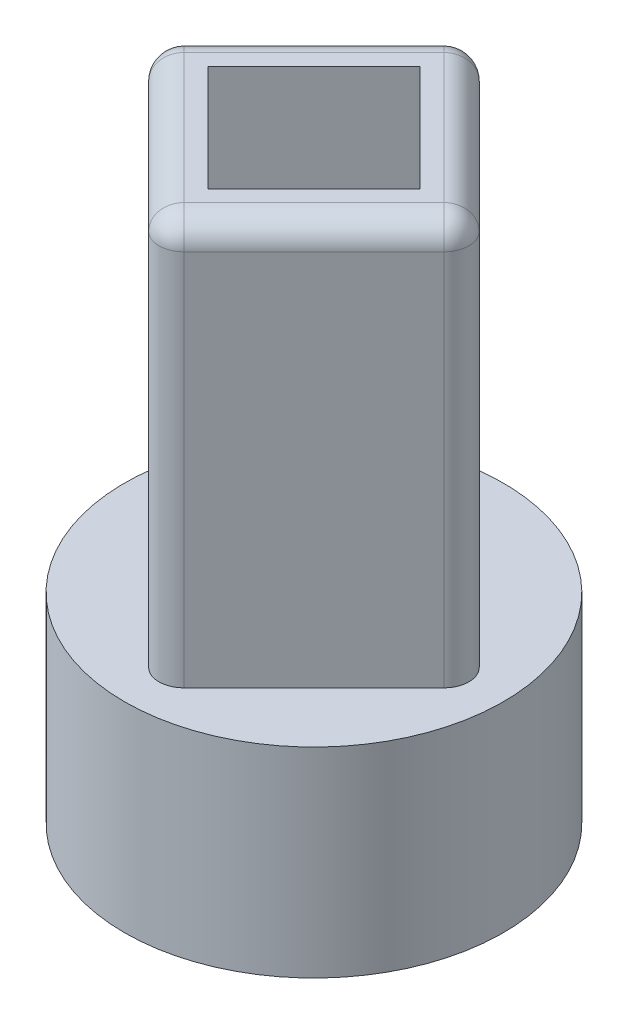
ISO-10303-21;
HEADER;
FILE_DESCRIPTION(('STEP AP214'),'2;1');
FILE_NAME('part.step','',(''),(''),'','','');
FILE_SCHEMA(('AUTOMOTIVE_DESIGN { 1 0 10303 214 1 1 1 1 }'));
ENDSEC;
DATA;
#1=APPLICATION_CONTEXT('core data for automotive mechanical design processes');
#2=APPLICATION_PROTOCOL_DEFINITION('international standard','automotive_design',2000,#1);
#3=PRODUCT_CONTEXT('',#1,'mechanical');
#4=PRODUCT('Part','Part','',(#3));
#5=PRODUCT_RELATED_PRODUCT_CATEGORY('part','',(#4));
#6=PRODUCT_DEFINITION_FORMATION('','',#4);
#7=PRODUCT_DEFINITION_CONTEXT('part definition',#1,'design');
#8=PRODUCT_DEFINITION('design','',#6,#7);
#9=PRODUCT_DEFINITION_SHAPE('','',#8);
#10=(LENGTH_UNIT() NAMED_UNIT(*) SI_UNIT(.MILLI.,.METRE.));
#11=(NAMED_UNIT(*) PLANE_ANGLE_UNIT() SI_UNIT($,.RADIAN.));
#12=(NAMED_UNIT(*) SI_UNIT($,.STERADIAN.) SOLID_ANGLE_UNIT());
#13=UNCERTAINTY_MEASURE_WITH_UNIT(LENGTH_MEASURE(1.E-05),#10,'distance_accuracy_value','');
#14=(GEOMETRIC_REPRESENTATION_CONTEXT(3) GLOBAL_UNCERTAINTY_ASSIGNED_CONTEXT((#13)) GLOBAL_UNIT_ASSIGNED_CONTEXT((#10,
#11,#12)) REPRESENTATION_CONTEXT('',''));
#15=CARTESIAN_POINT('',(0.,0.,0.));
#16=DIRECTION('',(0.,0.,1.));
#17=DIRECTION('',(1.,0.,0.));
#18=AXIS2_PLACEMENT_3D('',#15,#16,#17);
#19=CARTESIAN_POINT('',(0.,24.1,0.));
#20=DIRECTION('',(0.,1.,0.));
#21=DIRECTION('',(0.,0.,1.));
#22=AXIS2_PLACEMENT_3D('',#19,#20,#21);
#23=PLANE('',#22);
#24=DIRECTION('',(-0.707106781186548,0.,-0.707106781186547));
#25=VECTOR('',#24,1.);
#26=CARTESIAN_POINT('',(-0.70710678118655,24.1,-5.90434162290767));
#27=LINE('',#26,#25);
#28=CARTESIAN_POINT('',(5.19723484172112,24.1,0.));
#29=VERTEX_POINT('',#28);
#30=CARTESIAN_POINT('',(0.,24.1,-5.19723484172112));
#31=VERTEX_POINT('',#30);
#32=EDGE_CURVE('E286',#29,#31,#27,.T.);
#33=ORIENTED_EDGE('',*,*,#32,.T.);
#34=DIRECTION('',(-0.707106781186547,0.,0.707106781186548));
#35=VECTOR('',#34,1.);
#36=CARTESIAN_POINT('',(-5.90434162290767,24.1,0.707106781186549));
#37=LINE('',#36,#35);
#38=CARTESIAN_POINT('',(-5.19723484172112,24.1,0.));
#39=VERTEX_POINT('',#38);
#40=EDGE_CURVE('E292',#31,#39,#37,.T.);
#41=ORIENTED_EDGE('',*,*,#40,.T.);
#42=DIRECTION('',(0.707106781186548,0.,0.707106781186547));
#43=VECTOR('',#42,1.);
#44=CARTESIAN_POINT('',(0.707106781186548,24.1,5.90434162290767));
#45=LINE('',#44,#43);
#46=CARTESIAN_POINT('',(0.,24.1,5.19723484172112));
#47=VERTEX_POINT('',#46);
#48=EDGE_CURVE('E290',#39,#47,#45,.T.);
#49=ORIENTED_EDGE('',*,*,#48,.T.);
#50=DIRECTION('',(0.707106781186548,0.,-0.707106781186548));
#51=VECTOR('',#50,1.);
#52=CARTESIAN_POINT('',(5.90434162290767,24.1,-0.707106781186549));
#53=LINE('',#52,#51);
#54=EDGE_CURVE('E288',#47,#29,#53,.T.);
#55=ORIENTED_EDGE('',*,*,#54,.T.);
#56=EDGE_LOOP('',(#33,#41,#49,#55));
#57=FACE_BOUND('',#56,.T.);
#58=DIRECTION('',(-0.707106781186548,0.,-0.707106781186547));
#59=VECTOR('',#58,1.);
#60=CARTESIAN_POINT('',(4.24264068711928,24.1,0.));
#61=LINE('',#60,#59);
#62=CARTESIAN_POINT('',(4.24264068711928,24.1,0.));
#63=VERTEX_POINT('',#62);
#64=CARTESIAN_POINT('',(0.,24.1,-4.24264068711928));
#65=VERTEX_POINT('',#64);
#66=EDGE_CURVE('E249',#63,#65,#61,.T.);
#67=ORIENTED_EDGE('',*,*,#66,.F.);
#68=DIRECTION('',(0.707106781186548,0.,-0.707106781186548));
#69=VECTOR('',#68,1.);
#70=CARTESIAN_POINT('',(0.,24.1,4.24264068711928));
#71=LINE('',#70,#69);
#72=CARTESIAN_POINT('',(0.,24.1,4.24264068711928));
#73=VERTEX_POINT('',#72);
#74=EDGE_CURVE('E247',#73,#63,#71,.T.);
#75=ORIENTED_EDGE('',*,*,#74,.F.);
#76=DIRECTION('',(0.707106781186548,0.,0.707106781186547));
#77=VECTOR('',#76,1.);
#78=CARTESIAN_POINT('',(-4.24264068711928,24.1,0.));
#79=LINE('',#78,#77);
#80=CARTESIAN_POINT('',(-4.24264068711928,24.1,0.));
#81=VERTEX_POINT('',#80);
#82=EDGE_CURVE('E254',#81,#73,#79,.T.);
#83=ORIENTED_EDGE('',*,*,#82,.F.);
#84=DIRECTION('',(-0.707106781186547,0.,0.707106781186548));
#85=VECTOR('',#84,1.);
#86=CARTESIAN_POINT('',(0.,24.1,-4.24264068711928));
#87=LINE('',#86,#85);
#88=EDGE_CURVE('E251',#65,#81,#87,.T.);
#89=ORIENTED_EDGE('',*,*,#88,.F.);
#90=EDGE_LOOP('',(#67,#75,#83,#89));
#91=FACE_BOUND('',#90,.T.);
#92=ADVANCED_FACE('F43',(#57,#91),#23,.T.);
#93=CARTESIAN_POINT('',(0.,24.1,6.61144840409422));
#94=DIRECTION('',(-0.707106781186548,0.,-0.707106781186548));
#95=DIRECTION('',(-0.707106781186548,0.,0.707106781186548));
#96=AXIS2_PLACEMENT_3D('',#93,#94,#95);
#97=PLANE('',#96);
#98=DIRECTION('',(0.,-1.,0.));
#99=VECTOR('',#98,1.);
#100=CARTESIAN_POINT('',(0.707106781186547,24.1,5.90434162290767));
#101=LINE('',#100,#99);
#102=CARTESIAN_POINT('',(0.707106781186548,23.1,5.90434162290767));
#103=VERTEX_POINT('',#102);
#104=CARTESIAN_POINT('',(0.707106781186547,8.,5.90434162290767));
#105=VERTEX_POINT('',#104);
#106=EDGE_CURVE('E302',#103,#105,#101,.T.);
#107=ORIENTED_EDGE('',*,*,#106,.T.);
#108=DIRECTION('',(0.707106781186548,0.,-0.707106781186548));
#109=VECTOR('',#108,1.);
#110=CARTESIAN_POINT('',(0.707106781186548,8.,5.90434162290767));
#111=LINE('',#110,#109);
#112=CARTESIAN_POINT('',(5.90434162290767,8.,0.707106781186548));
#113=VERTEX_POINT('',#112);
#114=EDGE_CURVE('E60',#105,#113,#111,.T.);
#115=ORIENTED_EDGE('',*,*,#114,.T.);
#116=DIRECTION('',(0.,-1.,0.));
#117=VECTOR('',#116,1.);
#118=CARTESIAN_POINT('',(5.90434162290767,24.1,0.707106781186548));
#119=LINE('',#118,#117);
#120=CARTESIAN_POINT('',(5.90434162290767,23.1,0.707106781186547));
#121=VERTEX_POINT('',#120);
#122=EDGE_CURVE('E306',#113,#121,#119,.F.);
#123=ORIENTED_EDGE('',*,*,#122,.T.);
#124=DIRECTION('',(0.707106781186548,0.,-0.707106781186548));
#125=VECTOR('',#124,1.);
#126=CARTESIAN_POINT('',(0.,23.1,6.61144840409422));
#127=LINE('',#126,#125);
#128=EDGE_CURVE('E304',#121,#103,#127,.F.);
#129=ORIENTED_EDGE('',*,*,#128,.T.);
#130=EDGE_LOOP('',(#107,#115,#123,#129));
#131=FACE_BOUND('',#130,.T.);
#132=ADVANCED_FACE('F360',(#131),#97,.F.);
#133=CARTESIAN_POINT('',(6.61144840409422,24.1,0.));
#134=DIRECTION('',(-0.707106781186547,0.,0.707106781186548));
#135=DIRECTION('',(0.707106781186548,0.,0.707106781186547));
#136=AXIS2_PLACEMENT_3D('',#133,#134,#135);
#137=PLANE('',#136);
#138=DIRECTION('',(0.,-1.,0.));
#139=VECTOR('',#138,1.);
#140=CARTESIAN_POINT('',(5.90434162290767,24.1,-0.707106781186549));
#141=LINE('',#140,#139);
#142=CARTESIAN_POINT('',(5.90434162290767,23.1,-0.707106781186549));
#143=VERTEX_POINT('',#142);
#144=CARTESIAN_POINT('',(5.90434162290767,8.,-0.707106781186549));
#145=VERTEX_POINT('',#144);
#146=EDGE_CURVE('E11',#143,#145,#141,.T.);
#147=ORIENTED_EDGE('',*,*,#146,.T.);
#148=DIRECTION('',(-0.707106781186548,0.,-0.707106781186547));
#149=VECTOR('',#148,1.);
#150=CARTESIAN_POINT('',(5.90434162290767,8.,-0.707106781186549));
#151=LINE('',#150,#149);
#152=CARTESIAN_POINT('',(0.707106781186545,8.,-5.90434162290767));
#153=VERTEX_POINT('',#152);
#154=EDGE_CURVE('E207',#145,#153,#151,.T.);
#155=ORIENTED_EDGE('',*,*,#154,.T.);
#156=DIRECTION('',(0.,-1.,0.));
#157=VECTOR('',#156,1.);
#158=CARTESIAN_POINT('',(0.707106781186545,24.1,-5.90434162290767));
#159=LINE('',#158,#157);
#160=CARTESIAN_POINT('',(0.707106781186546,23.1,-5.90434162290767));
#161=VERTEX_POINT('',#160);
#162=EDGE_CURVE('E308',#153,#161,#159,.F.);
#163=ORIENTED_EDGE('',*,*,#162,.T.);
#164=DIRECTION('',(-0.707106781186548,0.,-0.707106781186547));
#165=VECTOR('',#164,1.);
#166=CARTESIAN_POINT('',(6.61144840409422,23.1,0.));
#167=LINE('',#166,#165);
#168=EDGE_CURVE('E52',#161,#143,#167,.F.);
#169=ORIENTED_EDGE('',*,*,#168,.T.);
#170=EDGE_LOOP('',(#147,#155,#163,#169));
#171=FACE_BOUND('',#170,.T.);
#172=ADVANCED_FACE('F369',(#171),#137,.F.);
#173=CARTESIAN_POINT('',(0.,24.1,-6.61144840409422));
#174=DIRECTION('',(0.707106781186548,0.,0.707106781186547));
#175=DIRECTION('',(0.707106781186547,0.,-0.707106781186548));
#176=AXIS2_PLACEMENT_3D('',#173,#174,#175);
#177=PLANE('',#176);
#178=DIRECTION('',(0.,-1.,0.));
#179=VECTOR('',#178,1.);
#180=CARTESIAN_POINT('',(-0.707106781186549,24.1,-5.90434162290767));
#181=LINE('',#180,#179);
#182=CARTESIAN_POINT('',(-0.707106781186549,23.1,-5.90434162290767));
#183=VERTEX_POINT('',#182);
#184=CARTESIAN_POINT('',(-0.707106781186549,8.,-5.90434162290767));
#185=VERTEX_POINT('',#184);
#186=EDGE_CURVE('E190',#183,#185,#181,.T.);
#187=ORIENTED_EDGE('',*,*,#186,.T.);
#188=DIRECTION('',(-0.707106781186547,0.,0.707106781186548));
#189=VECTOR('',#188,1.);
#190=CARTESIAN_POINT('',(-0.707106781186549,8.,-5.90434162290767));
#191=LINE('',#190,#189);
#192=CARTESIAN_POINT('',(-5.90434162290767,8.,-0.707106781186546));
#193=VERTEX_POINT('',#192);
#194=EDGE_CURVE('E187',#185,#193,#191,.T.);
#195=ORIENTED_EDGE('',*,*,#194,.T.);
#196=DIRECTION('',(0.,-1.,0.));
#197=VECTOR('',#196,1.);
#198=CARTESIAN_POINT('',(-5.90434162290767,24.1,-0.707106781186547));
#199=LINE('',#198,#197);
#200=CARTESIAN_POINT('',(-5.90434162290767,23.1,-0.707106781186547));
#201=VERTEX_POINT('',#200);
#202=EDGE_CURVE('E170',#193,#201,#199,.F.);
#203=ORIENTED_EDGE('',*,*,#202,.T.);
#204=DIRECTION('',(-0.707106781186547,0.,0.707106781186548));
#205=VECTOR('',#204,1.);
#206=CARTESIAN_POINT('',(0.,23.1,-6.61144840409422));
#207=LINE('',#206,#205);
#208=EDGE_CURVE('E183',#201,#183,#207,.F.);
#209=ORIENTED_EDGE('',*,*,#208,.T.);
#210=EDGE_LOOP('',(#187,#195,#203,#209));
#211=FACE_BOUND('',#210,.T.);
#212=ADVANCED_FACE('F188',(#211),#177,.F.);
#213=CARTESIAN_POINT('',(-6.61144840409422,24.1,0.));
#214=DIRECTION('',(0.707106781186547,0.,-0.707106781186547));
#215=DIRECTION('',(-0.707106781186548,0.,-0.707106781186547));
#216=AXIS2_PLACEMENT_3D('',#213,#214,#215);
#217=PLANE('',#216);
#218=DIRECTION('',(0.,-1.,0.));
#219=VECTOR('',#218,1.);
#220=CARTESIAN_POINT('',(-5.90434162290767,24.1,0.707106781186549));
#221=LINE('',#220,#219);
#222=CARTESIAN_POINT('',(-5.90434162290767,23.1,0.707106781186549));
#223=VERTEX_POINT('',#222);
#224=CARTESIAN_POINT('',(-5.90434162290767,8.,0.707106781186549));
#225=VERTEX_POINT('',#224);
#226=EDGE_CURVE('E182',#223,#225,#221,.T.);
#227=ORIENTED_EDGE('',*,*,#226,.T.);
#228=DIRECTION('',(0.707106781186548,0.,0.707106781186548));
#229=VECTOR('',#228,1.);
#230=CARTESIAN_POINT('',(-5.90434162290767,8.,0.707106781186549));
#231=LINE('',#230,#229);
#232=CARTESIAN_POINT('',(-0.707106781186547,8.,5.90434162290767));
#233=VERTEX_POINT('',#232);
#234=EDGE_CURVE('E199',#225,#233,#231,.T.);
#235=ORIENTED_EDGE('',*,*,#234,.T.);
#236=DIRECTION('',(0.,-1.,0.));
#237=VECTOR('',#236,1.);
#238=CARTESIAN_POINT('',(-0.707106781186547,24.1,5.90434162290767));
#239=LINE('',#238,#237);
#240=CARTESIAN_POINT('',(-0.707106781186548,23.1,5.90434162290767));
#241=VERTEX_POINT('',#240);
#242=EDGE_CURVE('E300',#233,#241,#239,.F.);
#243=ORIENTED_EDGE('',*,*,#242,.T.);
#244=DIRECTION('',(0.707106781186548,0.,0.707106781186547));
#245=VECTOR('',#244,1.);
#246=CARTESIAN_POINT('',(-6.61144840409422,23.1,0.));
#247=LINE('',#246,#245);
#248=EDGE_CURVE('E298',#241,#223,#247,.F.);
#249=ORIENTED_EDGE('',*,*,#248,.T.);
#250=EDGE_LOOP('',(#227,#235,#243,#249));
#251=FACE_BOUND('',#250,.T.);
#252=ADVANCED_FACE('F406',(#251),#217,.F.);
#253=CARTESIAN_POINT('',(0.,24.1,4.24264068711928));
#254=DIRECTION('',(-0.707106781186548,0.,-0.707106781186548));
#255=DIRECTION('',(-0.707106781186548,0.,0.707106781186548));
#256=AXIS2_PLACEMENT_3D('',#253,#254,#255);
#257=PLANE('',#256);
#258=DIRECTION('',(0.707106781186548,0.,-0.707106781186548));
#259=VECTOR('',#258,1.);
#260=CARTESIAN_POINT('',(0.,10.05,4.24264068711928));
#261=LINE('',#260,#259);
#262=CARTESIAN_POINT('',(0.,10.05,4.24264068711928));
#263=VERTEX_POINT('',#262);
#264=CARTESIAN_POINT('',(4.24264068711928,10.05,0.));
#265=VERTEX_POINT('',#264);
#266=EDGE_CURVE('E237',#263,#265,#261,.T.);
#267=ORIENTED_EDGE('',*,*,#266,.F.);
#268=DIRECTION('',(0.,-1.,0.));
#269=VECTOR('',#268,1.);
#270=CARTESIAN_POINT('',(0.,24.1,4.24264068711928));
#271=LINE('',#270,#269);
#272=EDGE_CURVE('E256',#73,#263,#271,.T.);
#273=ORIENTED_EDGE('',*,*,#272,.F.);
#274=ORIENTED_EDGE('',*,*,#74,.T.);
#275=DIRECTION('',(0.,-1.,0.));
#276=VECTOR('',#275,1.);
#277=CARTESIAN_POINT('',(4.24264068711928,24.1,0.));
#278=LINE('',#277,#276);
#279=EDGE_CURVE('E264',#63,#265,#278,.T.);
#280=ORIENTED_EDGE('',*,*,#279,.T.);
#281=EDGE_LOOP('',(#267,#273,#274,#280));
#282=FACE_BOUND('',#281,.T.);
#283=ADVANCED_FACE('F404',(#282),#257,.T.);
#284=CARTESIAN_POINT('',(4.24264068711928,24.1,0.));
#285=DIRECTION('',(-0.707106781186547,0.,0.707106781186548));
#286=DIRECTION('',(0.707106781186548,0.,0.707106781186547));
#287=AXIS2_PLACEMENT_3D('',#284,#285,#286);
#288=PLANE('',#287);
#289=DIRECTION('',(-0.707106781186548,0.,-0.707106781186547));
#290=VECTOR('',#289,1.);
#291=CARTESIAN_POINT('',(4.24264068711928,10.05,0.));
#292=LINE('',#291,#290);
#293=CARTESIAN_POINT('',(0.,10.05,-4.24264068711928));
#294=VERTEX_POINT('',#293);
#295=EDGE_CURVE('E240',#265,#294,#292,.T.);
#296=ORIENTED_EDGE('',*,*,#295,.F.);
#297=ORIENTED_EDGE('',*,*,#279,.F.);
#298=ORIENTED_EDGE('',*,*,#66,.T.);
#299=DIRECTION('',(0.,-1.,0.));
#300=VECTOR('',#299,1.);
#301=CARTESIAN_POINT('',(0.,24.1,-4.24264068711928));
#302=LINE('',#301,#300);
#303=EDGE_CURVE('E261',#65,#294,#302,.T.);
#304=ORIENTED_EDGE('',*,*,#303,.T.);
#305=EDGE_LOOP('',(#296,#297,#298,#304));
#306=FACE_BOUND('',#305,.T.);
#307=ADVANCED_FACE('F477',(#306),#288,.T.);
#308=CARTESIAN_POINT('',(0.,24.1,-4.24264068711928));
#309=DIRECTION('',(0.707106781186548,0.,0.707106781186547));
#310=DIRECTION('',(0.707106781186547,0.,-0.707106781186548));
#311=AXIS2_PLACEMENT_3D('',#308,#309,#310);
#312=PLANE('',#311);
#313=DIRECTION('',(-0.707106781186547,0.,0.707106781186548));
#314=VECTOR('',#313,1.);
#315=CARTESIAN_POINT('',(0.,10.05,-4.24264068711928));
#316=LINE('',#315,#314);
#317=CARTESIAN_POINT('',(-4.24264068711928,10.05,0.));
#318=VERTEX_POINT('',#317);
#319=EDGE_CURVE('E243',#294,#318,#316,.T.);
#320=ORIENTED_EDGE('',*,*,#319,.F.);
#321=ORIENTED_EDGE('',*,*,#303,.F.);
#322=ORIENTED_EDGE('',*,*,#88,.T.);
#323=DIRECTION('',(0.,-1.,0.));
#324=VECTOR('',#323,1.);
#325=CARTESIAN_POINT('',(-4.24264068711928,24.1,0.));
#326=LINE('',#325,#324);
#327=EDGE_CURVE('E258',#81,#318,#326,.T.);
#328=ORIENTED_EDGE('',*,*,#327,.T.);
#329=EDGE_LOOP('',(#320,#321,#322,#328));
#330=FACE_BOUND('',#329,.T.);
#331=ADVANCED_FACE('F486',(#330),#312,.T.);
#332=CARTESIAN_POINT('',(-4.24264068711928,24.1,0.));
#333=DIRECTION('',(0.707106781186547,0.,-0.707106781186548));
#334=DIRECTION('',(-0.707106781186548,0.,-0.707106781186547));
#335=AXIS2_PLACEMENT_3D('',#332,#333,#334);
#336=PLANE('',#335);
#337=DIRECTION('',(0.707106781186548,0.,0.707106781186547));
#338=VECTOR('',#337,1.);
#339=CARTESIAN_POINT('',(-4.24264068711928,10.05,0.));
#340=LINE('',#339,#338);
#341=EDGE_CURVE('E232',#318,#263,#340,.T.);
#342=ORIENTED_EDGE('',*,*,#341,.F.);
#343=ORIENTED_EDGE('',*,*,#327,.F.);
#344=ORIENTED_EDGE('',*,*,#82,.T.);
#345=ORIENTED_EDGE('',*,*,#272,.T.);
#346=EDGE_LOOP('',(#342,#343,#344,#345));
#347=FACE_BOUND('',#346,.T.);
#348=ADVANCED_FACE('F494',(#347),#336,.T.);
#349=CARTESIAN_POINT('',(5.19723484172112,24.1,0.));
#350=DIRECTION('',(0.,-1.,0.));
#351=DIRECTION('',(0.,0.,-1.));
#352=AXIS2_PLACEMENT_3D('',#349,#350,#351);
#353=CYLINDRICAL_SURFACE('',#352,1.);
#354=CARTESIAN_POINT('',(5.19723484172112,8.,0.));
#355=DIRECTION('',(0.,1.,0.));
#356=DIRECTION('',(0.,0.,1.));
#357=AXIS2_PLACEMENT_3D('',#354,#355,#356);
#358=CIRCLE('',#357,1.);
#359=EDGE_CURVE('E67',#113,#145,#358,.T.);
#360=ORIENTED_EDGE('',*,*,#359,.T.);
#361=ORIENTED_EDGE('',*,*,#146,.F.);
#362=CARTESIAN_POINT('',(5.19723484172112,23.1,0.));
#363=DIRECTION('',(0.,1.,0.));
#364=DIRECTION('',(0.,0.,1.));
#365=AXIS2_PLACEMENT_3D('',#362,#363,#364);
#366=CIRCLE('',#365,1.);
#367=EDGE_CURVE('E47',#121,#143,#366,.T.);
#368=ORIENTED_EDGE('',*,*,#367,.F.);
#369=ORIENTED_EDGE('',*,*,#122,.F.);
#370=EDGE_LOOP('',(#360,#361,#368,#369));
#371=FACE_BOUND('',#370,.T.);
#372=ADVANCED_FACE('F45',(#371),#353,.T.);
#373=CARTESIAN_POINT('',(2.59861742086056,23.1,2.59861742086056));
#374=DIRECTION('',(-0.707106781186548,0.,0.707106781186548));
#375=DIRECTION('',(0.707106781186548,0.,0.707106781186548));
#376=AXIS2_PLACEMENT_3D('',#373,#374,#375);
#377=CYLINDRICAL_SURFACE('',#376,1.);
#378=CARTESIAN_POINT('',(0.,23.1,5.19723484172112));
#379=DIRECTION('',(-0.707106781186547,0.,0.707106781186547));
#380=DIRECTION('',(0.707106781186548,0.,0.707106781186548));
#381=AXIS2_PLACEMENT_3D('',#378,#379,#380);
#382=CIRCLE('',#381,1.);
#383=EDGE_CURVE('E333',#103,#47,#382,.T.);
#384=ORIENTED_EDGE('',*,*,#383,.F.);
#385=ORIENTED_EDGE('',*,*,#128,.F.);
#386=CARTESIAN_POINT('',(5.19723484172112,23.1,0.));
#387=DIRECTION('',(0.707106781186548,0.,-0.707106781186547));
#388=DIRECTION('',(-0.707106781186547,0.,-0.707106781186548));
#389=AXIS2_PLACEMENT_3D('',#386,#387,#388);
#390=CIRCLE('',#389,1.);
#391=EDGE_CURVE('E335',#29,#121,#390,.T.);
#392=ORIENTED_EDGE('',*,*,#391,.F.);
#393=ORIENTED_EDGE('',*,*,#54,.F.);
#394=EDGE_LOOP('',(#384,#385,#392,#393));
#395=FACE_BOUND('',#394,.T.);
#396=ADVANCED_FACE('F358',(#395),#377,.T.);
#397=CARTESIAN_POINT('',(0.,24.1,5.19723484172112));
#398=DIRECTION('',(0.,-1.,0.));
#399=DIRECTION('',(0.,0.,-1.));
#400=AXIS2_PLACEMENT_3D('',#397,#398,#399);
#401=CYLINDRICAL_SURFACE('',#400,1.);
#402=CARTESIAN_POINT('',(0.,8.,5.19723484172112));
#403=DIRECTION('',(0.,1.,0.));
#404=DIRECTION('',(0.,0.,1.));
#405=AXIS2_PLACEMENT_3D('',#402,#403,#404);
#406=CIRCLE('',#405,1.);
#407=EDGE_CURVE('E201',#233,#105,#406,.T.);
#408=ORIENTED_EDGE('',*,*,#407,.T.);
#409=ORIENTED_EDGE('',*,*,#106,.F.);
#410=CARTESIAN_POINT('',(0.,23.1,5.19723484172112));
#411=DIRECTION('',(0.,1.,0.));
#412=DIRECTION('',(0.,0.,1.));
#413=AXIS2_PLACEMENT_3D('',#410,#411,#412);
#414=CIRCLE('',#413,1.);
#415=EDGE_CURVE('E330',#241,#103,#414,.T.);
#416=ORIENTED_EDGE('',*,*,#415,.F.);
#417=ORIENTED_EDGE('',*,*,#242,.F.);
#418=EDGE_LOOP('',(#408,#409,#416,#417));
#419=FACE_BOUND('',#418,.T.);
#420=ADVANCED_FACE('F363',(#419),#401,.T.);
#421=CARTESIAN_POINT('',(5.19723484172112,23.1,0.));
#422=DIRECTION('',(0.707106781186548,0.,0.707106781186547));
#423=DIRECTION('',(0.707106781186547,0.,-0.707106781186548));
#424=AXIS2_PLACEMENT_3D('',#421,#422,#423);
#425=SPHERICAL_SURFACE('',#424,1.);
#426=ORIENTED_EDGE('',*,*,#391,.T.);
#427=ORIENTED_EDGE('',*,*,#367,.T.);
#428=CARTESIAN_POINT('',(5.19723484172112,23.1,0.));
#429=DIRECTION('',(0.707106781186548,0.,0.707106781186547));
#430=DIRECTION('',(0.707106781186547,0.,-0.707106781186548));
#431=AXIS2_PLACEMENT_3D('',#428,#429,#430);
#432=CIRCLE('',#431,1.);
#433=EDGE_CURVE('E327',#29,#143,#432,.F.);
#434=ORIENTED_EDGE('',*,*,#433,.F.);
#435=EDGE_LOOP('',(#426,#427,#434));
#436=FACE_BOUND('',#435,.T.);
#437=ADVANCED_FACE('F342',(#436),#425,.T.);
#438=CARTESIAN_POINT('',(0.,23.1,5.19723484172112));
#439=DIRECTION('',(0.707106781186548,0.,0.707106781186547));
#440=DIRECTION('',(0.707106781186547,0.,-0.707106781186548));
#441=AXIS2_PLACEMENT_3D('',#438,#439,#440);
#442=SPHERICAL_SURFACE('',#441,1.);
#443=ORIENTED_EDGE('',*,*,#415,.T.);
#444=ORIENTED_EDGE('',*,*,#383,.T.);
#445=CARTESIAN_POINT('',(0.,23.1,5.19723484172112));
#446=DIRECTION('',(0.707106781186548,0.,0.707106781186547));
#447=DIRECTION('',(0.707106781186547,0.,-0.707106781186548));
#448=AXIS2_PLACEMENT_3D('',#445,#446,#447);
#449=CIRCLE('',#448,1.);
#450=EDGE_CURVE('E324',#241,#47,#449,.F.);
#451=ORIENTED_EDGE('',*,*,#450,.F.);
#452=EDGE_LOOP('',(#443,#444,#451));
#453=FACE_BOUND('',#452,.T.);
#454=ADVANCED_FACE('F384',(#453),#442,.T.);
#455=CARTESIAN_POINT('',(0.,24.1,-5.19723484172112));
#456=DIRECTION('',(0.,-1.,0.));
#457=DIRECTION('',(0.,0.,-1.));
#458=AXIS2_PLACEMENT_3D('',#455,#456,#457);
#459=CYLINDRICAL_SURFACE('',#458,1.);
#460=CARTESIAN_POINT('',(0.,8.,-5.19723484172112));
#461=DIRECTION('',(0.,1.,0.));
#462=DIRECTION('',(0.,0.,1.));
#463=AXIS2_PLACEMENT_3D('',#460,#461,#462);
#464=CIRCLE('',#463,1.);
#465=EDGE_CURVE('E194',#153,#185,#464,.T.);
#466=ORIENTED_EDGE('',*,*,#465,.T.);
#467=ORIENTED_EDGE('',*,*,#186,.F.);
#468=CARTESIAN_POINT('',(0.,23.1,-5.19723484172112));
#469=DIRECTION('',(0.,1.,0.));
#470=DIRECTION('',(0.,0.,1.));
#471=AXIS2_PLACEMENT_3D('',#468,#469,#470);
#472=CIRCLE('',#471,1.);
#473=EDGE_CURVE('E321',#161,#183,#472,.T.);
#474=ORIENTED_EDGE('',*,*,#473,.F.);
#475=ORIENTED_EDGE('',*,*,#162,.F.);
#476=EDGE_LOOP('',(#466,#467,#474,#475));
#477=FACE_BOUND('',#476,.T.);
#478=ADVANCED_FACE('F371',(#477),#459,.T.);
#479=CARTESIAN_POINT('',(2.59861742086056,23.1,-2.59861742086056));
#480=DIRECTION('',(0.707106781186548,0.,0.707106781186547));
#481=DIRECTION('',(0.707106781186547,0.,-0.707106781186548));
#482=AXIS2_PLACEMENT_3D('',#479,#480,#481);
#483=CYLINDRICAL_SURFACE('',#482,1.);
#484=ORIENTED_EDGE('',*,*,#433,.T.);
#485=ORIENTED_EDGE('',*,*,#168,.F.);
#486=CARTESIAN_POINT('',(0.,23.1,-5.19723484172112));
#487=DIRECTION('',(-0.707106781186547,0.,-0.707106781186547));
#488=DIRECTION('',(-0.707106781186548,0.,0.707106781186548));
#489=AXIS2_PLACEMENT_3D('',#486,#487,#488);
#490=CIRCLE('',#489,1.);
#491=EDGE_CURVE('E318',#31,#161,#490,.T.);
#492=ORIENTED_EDGE('',*,*,#491,.F.);
#493=ORIENTED_EDGE('',*,*,#32,.F.);
#494=EDGE_LOOP('',(#484,#485,#492,#493));
#495=FACE_BOUND('',#494,.T.);
#496=ADVANCED_FACE('F346',(#495),#483,.T.);
#497=CARTESIAN_POINT('',(-2.59861742086056,23.1,2.59861742086056));
#498=DIRECTION('',(-0.707106781186548,0.,-0.707106781186547));
#499=DIRECTION('',(-0.707106781186547,0.,0.707106781186548));
#500=AXIS2_PLACEMENT_3D('',#497,#498,#499);
#501=CYLINDRICAL_SURFACE('',#500,1.);
#502=ORIENTED_EDGE('',*,*,#450,.T.);
#503=ORIENTED_EDGE('',*,*,#48,.F.);
#504=CARTESIAN_POINT('',(-5.19723484172112,23.1,0.));
#505=DIRECTION('',(-0.707106781186547,0.,-0.707106781186547));
#506=DIRECTION('',(-0.707106781186548,0.,0.707106781186548));
#507=AXIS2_PLACEMENT_3D('',#504,#505,#506);
#508=CIRCLE('',#507,1.);
#509=EDGE_CURVE('E315',#223,#39,#508,.T.);
#510=ORIENTED_EDGE('',*,*,#509,.F.);
#511=ORIENTED_EDGE('',*,*,#248,.F.);
#512=EDGE_LOOP('',(#502,#503,#510,#511));
#513=FACE_BOUND('',#512,.T.);
#514=ADVANCED_FACE('F382',(#513),#501,.T.);
#515=CARTESIAN_POINT('',(-5.19723484172112,24.1,0.));
#516=DIRECTION('',(0.,-1.,0.));
#517=DIRECTION('',(0.,0.,-1.));
#518=AXIS2_PLACEMENT_3D('',#515,#516,#517);
#519=CYLINDRICAL_SURFACE('',#518,1.);
#520=CARTESIAN_POINT('',(-5.19723484172112,8.,0.));
#521=DIRECTION('',(0.,1.,0.));
#522=DIRECTION('',(0.,0.,1.));
#523=AXIS2_PLACEMENT_3D('',#520,#521,#522);
#524=CIRCLE('',#523,1.);
#525=EDGE_CURVE('E175',#193,#225,#524,.T.);
#526=ORIENTED_EDGE('',*,*,#525,.T.);
#527=ORIENTED_EDGE('',*,*,#226,.F.);
#528=CARTESIAN_POINT('',(-5.19723484172112,23.1,0.));
#529=DIRECTION('',(0.,1.,0.));
#530=DIRECTION('',(0.,0.,1.));
#531=AXIS2_PLACEMENT_3D('',#528,#529,#530);
#532=CIRCLE('',#531,1.);
#533=EDGE_CURVE('E178',#201,#223,#532,.T.);
#534=ORIENTED_EDGE('',*,*,#533,.F.);
#535=ORIENTED_EDGE('',*,*,#202,.F.);
#536=EDGE_LOOP('',(#526,#527,#534,#535));
#537=FACE_BOUND('',#536,.T.);
#538=ADVANCED_FACE('F172',(#537),#519,.T.);
#539=CARTESIAN_POINT('',(0.,23.1,-5.19723484172112));
#540=DIRECTION('',(0.707106781186547,0.,-0.707106781186548));
#541=DIRECTION('',(-0.707106781186548,0.,-0.707106781186547));
#542=AXIS2_PLACEMENT_3D('',#539,#540,#541);
#543=SPHERICAL_SURFACE('',#542,1.);
#544=ORIENTED_EDGE('',*,*,#491,.T.);
#545=ORIENTED_EDGE('',*,*,#473,.T.);
#546=CARTESIAN_POINT('',(0.,23.1,-5.19723484172112));
#547=DIRECTION('',(0.707106781186547,0.,-0.707106781186548));
#548=DIRECTION('',(-0.707106781186548,0.,-0.707106781186547));
#549=AXIS2_PLACEMENT_3D('',#546,#547,#548);
#550=CIRCLE('',#549,1.);
#551=EDGE_CURVE('E312',#31,#183,#550,.F.);
#552=ORIENTED_EDGE('',*,*,#551,.F.);
#553=EDGE_LOOP('',(#544,#545,#552));
#554=FACE_BOUND('',#553,.T.);
#555=ADVANCED_FACE('F373',(#554),#543,.T.);
#556=CARTESIAN_POINT('',(-5.19723484172112,23.1,0.));
#557=DIRECTION('',(-0.707106781186548,0.,0.707106781186547));
#558=DIRECTION('',(0.707106781186547,0.,0.707106781186548));
#559=AXIS2_PLACEMENT_3D('',#556,#557,#558);
#560=SPHERICAL_SURFACE('',#559,1.);
#561=ORIENTED_EDGE('',*,*,#533,.T.);
#562=ORIENTED_EDGE('',*,*,#509,.T.);
#563=CARTESIAN_POINT('',(-5.19723484172112,23.1,0.));
#564=DIRECTION('',(-0.707106781186547,0.,0.707106781186548));
#565=DIRECTION('',(0.707106781186548,0.,0.707106781186547));
#566=AXIS2_PLACEMENT_3D('',#563,#564,#565);
#567=CIRCLE('',#566,1.);
#568=EDGE_CURVE('E246',#201,#39,#567,.F.);
#569=ORIENTED_EDGE('',*,*,#568,.F.);
#570=EDGE_LOOP('',(#561,#562,#569));
#571=FACE_BOUND('',#570,.T.);
#572=ADVANCED_FACE('F379',(#571),#560,.T.);
#573=CARTESIAN_POINT('',(-2.59861742086056,23.1,-2.59861742086056));
#574=DIRECTION('',(0.707106781186547,0.,-0.707106781186548));
#575=DIRECTION('',(-0.707106781186548,0.,-0.707106781186547));
#576=AXIS2_PLACEMENT_3D('',#573,#574,#575);
#577=CYLINDRICAL_SURFACE('',#576,1.);
#578=ORIENTED_EDGE('',*,*,#551,.T.);
#579=ORIENTED_EDGE('',*,*,#208,.F.);
#580=ORIENTED_EDGE('',*,*,#568,.T.);
#581=ORIENTED_EDGE('',*,*,#40,.F.);
#582=EDGE_LOOP('',(#578,#579,#580,#581));
#583=FACE_BOUND('',#582,.T.);
#584=ADVANCED_FACE('F375',(#583),#577,.T.);
#585=CARTESIAN_POINT('',(0.,10.05,0.));
#586=DIRECTION('',(0.,1.,0.));
#587=DIRECTION('',(0.,0.,1.));
#588=AXIS2_PLACEMENT_3D('',#585,#586,#587);
#589=PLANE('',#588);
#590=CARTESIAN_POINT('',(0.,10.05,0.));
#591=DIRECTION('',(0.,1.,0.));
#592=DIRECTION('',(0.,0.,1.));
#593=AXIS2_PLACEMENT_3D('',#590,#591,#592);
#594=CIRCLE('',#593,1.875);
#595=CARTESIAN_POINT('',(0.,10.05,1.875));
#596=VERTEX_POINT('',#595);
#597=EDGE_CURVE('E226',#596,#596,#594,.T.);
#598=ORIENTED_EDGE('',*,*,#597,.F.);
#599=EDGE_LOOP('',(#598));
#600=FACE_BOUND('',#599,.T.);
#601=ORIENTED_EDGE('',*,*,#341,.T.);
#602=ORIENTED_EDGE('',*,*,#266,.T.);
#603=ORIENTED_EDGE('',*,*,#295,.T.);
#604=ORIENTED_EDGE('',*,*,#319,.T.);
#605=EDGE_LOOP('',(#601,#602,#603,#604));
#606=FACE_BOUND('',#605,.T.);
#607=ADVANCED_FACE('F436',(#600,#606),#589,.T.);
#608=CARTESIAN_POINT('',(0.,12.6,0.));
#609=DIRECTION('',(0.,-1.,0.));
#610=DIRECTION('',(0.,0.,-1.));
#611=AXIS2_PLACEMENT_3D('',#608,#609,#610);
#612=CYLINDRICAL_SURFACE('',#611,1.875);
#613=CARTESIAN_POINT('',(0.,12.6,0.));
#614=DIRECTION('',(0.,1.,0.));
#615=DIRECTION('',(0.,0.,1.));
#616=AXIS2_PLACEMENT_3D('',#613,#614,#615);
#617=CIRCLE('',#616,1.875);
#618=CARTESIAN_POINT('',(0.,12.6,1.875));
#619=VERTEX_POINT('',#618);
#620=EDGE_CURVE('E229',#619,#619,#617,.T.);
#621=ORIENTED_EDGE('',*,*,#620,.F.);
#622=EDGE_LOOP('',(#621));
#623=FACE_BOUND('',#622,.T.);
#624=ORIENTED_EDGE('',*,*,#597,.T.);
#625=EDGE_LOOP('',(#624));
#626=FACE_BOUND('',#625,.T.);
#627=ADVANCED_FACE('F511',(#623,#626),#612,.T.);
#628=CARTESIAN_POINT('',(0.,12.6,0.));
#629=DIRECTION('',(0.,1.,0.));
#630=DIRECTION('',(0.,0.,1.));
#631=AXIS2_PLACEMENT_3D('',#628,#629,#630);
#632=PLANE('',#631);
#633=ORIENTED_EDGE('',*,*,#620,.T.);
#634=EDGE_LOOP('',(#633));
#635=FACE_BOUND('',#634,.T.);
#636=ADVANCED_FACE('F520',(#635),#632,.T.);
#637=CARTESIAN_POINT('',(0.,8.,0.));
#638=DIRECTION('',(0.,1.,0.));
#639=DIRECTION('',(0.,0.,1.));
#640=AXIS2_PLACEMENT_3D('',#637,#638,#639);
#641=PLANE('',#640);
#642=CARTESIAN_POINT('',(0.,8.,0.));
#643=DIRECTION('',(0.,1.,0.));
#644=DIRECTION('',(0.,0.,1.));
#645=AXIS2_PLACEMENT_3D('',#642,#643,#644);
#646=CIRCLE('',#645,7.575);
#647=CARTESIAN_POINT('',(0.,8.,7.575));
#648=VERTEX_POINT('',#647);
#649=EDGE_CURVE('E193',#648,#648,#646,.T.);
#650=ORIENTED_EDGE('',*,*,#649,.T.);
#651=EDGE_LOOP('',(#650));
#652=FACE_BOUND('',#651,.T.);
#653=ORIENTED_EDGE('',*,*,#234,.F.);
#654=ORIENTED_EDGE('',*,*,#525,.F.);
#655=ORIENTED_EDGE('',*,*,#194,.F.);
#656=ORIENTED_EDGE('',*,*,#465,.F.);
#657=ORIENTED_EDGE('',*,*,#154,.F.);
#658=ORIENTED_EDGE('',*,*,#359,.F.);
#659=ORIENTED_EDGE('',*,*,#114,.F.);
#660=ORIENTED_EDGE('',*,*,#407,.F.);
#661=EDGE_LOOP('',(#653,#654,#655,#656,#657,#658,#659,#660));
#662=FACE_BOUND('',#661,.T.);
#663=ADVANCED_FACE('F197',(#652,#662),#641,.T.);
#664=CARTESIAN_POINT('',(0.,7.6,0.));
#665=DIRECTION('',(0.,-1.,0.));
#666=DIRECTION('',(0.,0.,-1.));
#667=AXIS2_PLACEMENT_3D('',#664,#665,#666);
#668=PLANE('',#667);
#669=CARTESIAN_POINT('',(0.,7.6,0.));
#670=DIRECTION('',(0.,-1.,0.));
#671=DIRECTION('',(0.,0.,-1.));
#672=AXIS2_PLACEMENT_3D('',#669,#670,#671);
#673=CIRCLE('',#672,2.875);
#674=CARTESIAN_POINT('',(-1.9,7.6,2.15768973673232));
#675=VERTEX_POINT('',#674);
#676=CARTESIAN_POINT('',(1.9,7.6,2.15768973673232));
#677=VERTEX_POINT('',#676);
#678=EDGE_CURVE('E213',#675,#677,#673,.T.);
#679=ORIENTED_EDGE('',*,*,#678,.T.);
#680=DIRECTION('',(-1.,0.,0.));
#681=VECTOR('',#680,1.);
#682=CARTESIAN_POINT('',(-1.9,7.6,2.15768973673232));
#683=LINE('',#682,#681);
#684=EDGE_CURVE('E216',#677,#675,#683,.T.);
#685=ORIENTED_EDGE('',*,*,#684,.T.);
#686=EDGE_LOOP('',(#679,#685));
#687=FACE_BOUND('',#686,.T.);
#688=ADVANCED_FACE('F552',(#687),#668,.T.);
#689=CARTESIAN_POINT('',(-1.9,7.6,2.15768973673232));
#690=DIRECTION('',(0.,0.,1.));
#691=DIRECTION('',(1.,0.,0.));
#692=AXIS2_PLACEMENT_3D('',#689,#690,#691);
#693=PLANE('',#692);
#694=DIRECTION('',(-1.,0.,0.));
#695=VECTOR('',#694,1.);
#696=CARTESIAN_POINT('',(-1.9,3.6,2.15768973673232));
#697=LINE('',#696,#695);
#698=CARTESIAN_POINT('',(1.9,3.6,2.15768973673232));
#699=VERTEX_POINT('',#698);
#700=CARTESIAN_POINT('',(-1.9,3.6,2.15768973673232));
#701=VERTEX_POINT('',#700);
#702=EDGE_CURVE('E217',#699,#701,#697,.T.);
#703=ORIENTED_EDGE('',*,*,#702,.T.);
#704=DIRECTION('',(0.,-1.,0.));
#705=VECTOR('',#704,1.);
#706=CARTESIAN_POINT('',(-1.9,7.6,2.15768973673232));
#707=LINE('',#706,#705);
#708=EDGE_CURVE('E224',#675,#701,#707,.T.);
#709=ORIENTED_EDGE('',*,*,#708,.F.);
#710=ORIENTED_EDGE('',*,*,#684,.F.);
#711=DIRECTION('',(0.,-1.,0.));
#712=VECTOR('',#711,1.);
#713=CARTESIAN_POINT('',(1.9,7.6,2.15768973673232));
#714=LINE('',#713,#712);
#715=EDGE_CURVE('E220',#677,#699,#714,.T.);
#716=ORIENTED_EDGE('',*,*,#715,.T.);
#717=EDGE_LOOP('',(#703,#709,#710,#716));
#718=FACE_BOUND('',#717,.T.);
#719=ADVANCED_FACE('F543',(#718),#693,.F.);
#720=CARTESIAN_POINT('',(0.,7.6,0.));
#721=DIRECTION('',(0.,-1.,0.));
#722=DIRECTION('',(0.,0.,-1.));
#723=AXIS2_PLACEMENT_3D('',#720,#721,#722);
#724=CYLINDRICAL_SURFACE('',#723,2.875);
#725=CARTESIAN_POINT('',(0.,3.6,0.));
#726=DIRECTION('',(0.,-1.,0.));
#727=DIRECTION('',(0.,0.,-1.));
#728=AXIS2_PLACEMENT_3D('',#725,#726,#727);
#729=CIRCLE('',#728,2.875);
#730=EDGE_CURVE('E212',#701,#699,#729,.T.);
#731=ORIENTED_EDGE('',*,*,#730,.T.);
#732=ORIENTED_EDGE('',*,*,#715,.F.);
#733=ORIENTED_EDGE('',*,*,#678,.F.);
#734=ORIENTED_EDGE('',*,*,#708,.T.);
#735=EDGE_LOOP('',(#731,#732,#733,#734));
#736=FACE_BOUND('',#735,.T.);
#737=ADVANCED_FACE('F418',(#736),#724,.F.);
#738=CARTESIAN_POINT('',(0.,3.6,0.));
#739=DIRECTION('',(0.,-1.,0.));
#740=DIRECTION('',(0.,0.,-1.));
#741=AXIS2_PLACEMENT_3D('',#738,#739,#740);
#742=PLANE('',#741);
#743=ORIENTED_EDGE('',*,*,#730,.F.);
#744=ORIENTED_EDGE('',*,*,#702,.F.);
#745=EDGE_LOOP('',(#743,#744));
#746=FACE_BOUND('',#745,.T.);
#747=CARTESIAN_POINT('',(0.,3.6,0.));
#748=DIRECTION('',(0.,-1.,0.));
#749=DIRECTION('',(0.,0.,-1.));
#750=AXIS2_PLACEMENT_3D('',#747,#748,#749);
#751=CIRCLE('',#750,4.575);
#752=CARTESIAN_POINT('',(0.,3.6,-4.575));
#753=VERTEX_POINT('',#752);
#754=CARTESIAN_POINT('',(-4.35933050243434,3.6,-1.38811475409836));
#755=VERTEX_POINT('',#754);
#756=EDGE_CURVE('E268',#753,#755,#751,.T.);
#757=ORIENTED_EDGE('',*,*,#756,.T.);
#758=DIRECTION('',(0.80728342637673,0.,-0.590163934426229));
#759=VECTOR('',#758,1.);
#760=CARTESIAN_POINT('',(-4.35933050243434,3.6,-1.38811475409836));
#761=LINE('',#760,#759);
#762=EDGE_CURVE('E271',#755,#753,#761,.T.);
#763=ORIENTED_EDGE('',*,*,#762,.T.);
#764=EDGE_LOOP('',(#757,#763));
#765=FACE_BOUND('',#764,.T.);
#766=ADVANCED_FACE('F414',(#746,#765),#742,.T.);
#767=CARTESIAN_POINT('',(0.,3.6,0.));
#768=DIRECTION('',(0.,-1.,0.));
#769=DIRECTION('',(0.,0.,-1.));
#770=AXIS2_PLACEMENT_3D('',#767,#768,#769);
#771=CYLINDRICAL_SURFACE('',#770,4.575);
#772=CARTESIAN_POINT('',(0.,0.,0.));
#773=DIRECTION('',(0.,-1.,0.));
#774=DIRECTION('',(0.,0.,-1.));
#775=AXIS2_PLACEMENT_3D('',#772,#773,#774);
#776=CIRCLE('',#775,4.575);
#777=CARTESIAN_POINT('',(0.,0.,-4.575));
#778=VERTEX_POINT('',#777);
#779=CARTESIAN_POINT('',(-4.35933050243434,0.,-1.38811475409836));
#780=VERTEX_POINT('',#779);
#781=EDGE_CURVE('E267',#778,#780,#776,.T.);
#782=ORIENTED_EDGE('',*,*,#781,.T.);
#783=DIRECTION('',(0.,-1.,0.));
#784=VECTOR('',#783,1.);
#785=CARTESIAN_POINT('',(-4.35933050243434,3.6,-1.38811475409836));
#786=LINE('',#785,#784);
#787=EDGE_CURVE('E275',#755,#780,#786,.T.);
#788=ORIENTED_EDGE('',*,*,#787,.F.);
#789=ORIENTED_EDGE('',*,*,#756,.F.);
#790=DIRECTION('',(0.,-1.,0.));
#791=VECTOR('',#790,1.);
#792=CARTESIAN_POINT('',(0.,3.6,-4.575));
#793=LINE('',#792,#791);
#794=EDGE_CURVE('E279',#753,#778,#793,.T.);
#795=ORIENTED_EDGE('',*,*,#794,.T.);
#796=EDGE_LOOP('',(#782,#788,#789,#795));
#797=FACE_BOUND('',#796,.T.);
#798=ADVANCED_FACE('F417',(#797),#771,.F.);
#799=CARTESIAN_POINT('',(-4.35933050243434,3.6,-1.38811475409836));
#800=DIRECTION('',(-0.590163934426229,0.,-0.80728342637673));
#801=DIRECTION('',(-0.80728342637673,0.,0.590163934426229));
#802=AXIS2_PLACEMENT_3D('',#799,#800,#801);
#803=PLANE('',#802);
#804=DIRECTION('',(0.80728342637673,0.,-0.590163934426229));
#805=VECTOR('',#804,1.);
#806=CARTESIAN_POINT('',(-4.35933050243434,0.,-1.38811475409836));
#807=LINE('',#806,#805);
#808=EDGE_CURVE('E272',#780,#778,#807,.T.);
#809=ORIENTED_EDGE('',*,*,#808,.T.);
#810=ORIENTED_EDGE('',*,*,#794,.F.);
#811=ORIENTED_EDGE('',*,*,#762,.F.);
#812=ORIENTED_EDGE('',*,*,#787,.T.);
#813=EDGE_LOOP('',(#809,#810,#811,#812));
#814=FACE_BOUND('',#813,.T.);
#815=ADVANCED_FACE('F420',(#814),#803,.F.);
#816=CARTESIAN_POINT('',(0.,0.,0.));
#817=DIRECTION('',(0.,1.,0.));
#818=DIRECTION('',(0.,0.,1.));
#819=AXIS2_PLACEMENT_3D('',#816,#817,#818);
#820=PLANE('',#819);
#821=ORIENTED_EDGE('',*,*,#808,.F.);
#822=ORIENTED_EDGE('',*,*,#781,.F.);
#823=EDGE_LOOP('',(#821,#822));
#824=FACE_BOUND('',#823,.T.);
#825=CARTESIAN_POINT('',(0.,0.,0.));
#826=DIRECTION('',(0.,1.,0.));
#827=DIRECTION('',(0.,0.,1.));
#828=AXIS2_PLACEMENT_3D('',#825,#826,#827);
#829=CIRCLE('',#828,7.575);
#830=CARTESIAN_POINT('',(0.,0.,7.575));
#831=VERTEX_POINT('',#830);
#832=EDGE_CURVE('E281',#831,#831,#829,.T.);
#833=ORIENTED_EDGE('',*,*,#832,.F.);
#834=EDGE_LOOP('',(#833));
#835=FACE_BOUND('',#834,.T.);
#836=ADVANCED_FACE('F422',(#824,#835),#820,.F.);
#837=CARTESIAN_POINT('',(0.,5.2,0.));
#838=DIRECTION('',(0.,-1.,0.));
#839=DIRECTION('',(0.,0.,-1.));
#840=AXIS2_PLACEMENT_3D('',#837,#838,#839);
#841=CYLINDRICAL_SURFACE('',#840,7.575);
#842=ORIENTED_EDGE('',*,*,#832,.T.);
#843=EDGE_LOOP('',(#842));
#844=FACE_BOUND('',#843,.T.);
#845=ORIENTED_EDGE('',*,*,#649,.F.);
#846=EDGE_LOOP('',(#845));
#847=FACE_BOUND('',#846,.T.);
#848=ADVANCED_FACE('F429',(#844,#847),#841,.T.);
#849=CLOSED_SHELL('',(#92,#132,#172,#212,#252,#283,#307,#331,#348,#372,#396,#420,#437,#454,#478,
#496,#514,#538,#555,#572,#584,#607,#627,#636,#663,#688,#719,#737,#766,#798,#815,#836,#848));
#850=MANIFOLD_SOLID_BREP('B2',#849);
#851=ADVANCED_BREP_SHAPE_REPRESENTATION('',(#18,#850),#14);
#852=SHAPE_DEFINITION_REPRESENTATION(#9,#851);
ENDSEC;
END-ISO-10303-21;
